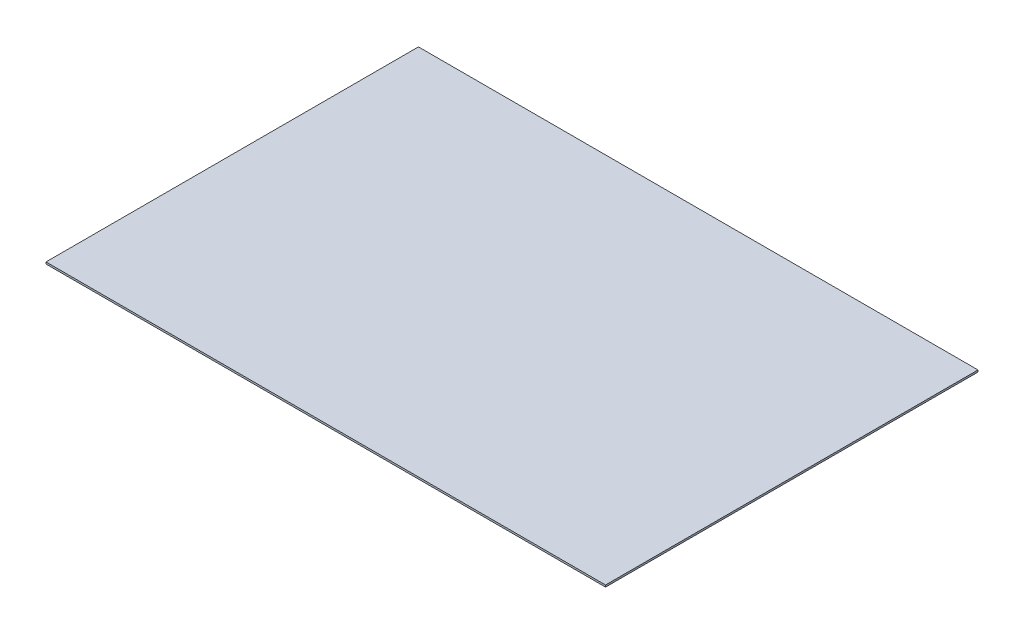
ISO-10303-21;
HEADER;
FILE_DESCRIPTION(('STEP AP214'),'2;1');
FILE_NAME('part.step','',(''),(''),'','','');
FILE_SCHEMA(('AUTOMOTIVE_DESIGN { 1 0 10303 214 1 1 1 1 }'));
ENDSEC;
DATA;
#1=APPLICATION_CONTEXT('core data for automotive mechanical design processes');
#2=APPLICATION_PROTOCOL_DEFINITION('international standard','automotive_design',2000,#1);
#3=PRODUCT_CONTEXT('',#1,'mechanical');
#4=PRODUCT('Part','Part','',(#3));
#5=PRODUCT_RELATED_PRODUCT_CATEGORY('part','',(#4));
#6=PRODUCT_DEFINITION_FORMATION('','',#4);
#7=PRODUCT_DEFINITION_CONTEXT('part definition',#1,'design');
#8=PRODUCT_DEFINITION('design','',#6,#7);
#9=PRODUCT_DEFINITION_SHAPE('','',#8);
#10=(LENGTH_UNIT() NAMED_UNIT(*) SI_UNIT(.MILLI.,.METRE.));
#11=(NAMED_UNIT(*) PLANE_ANGLE_UNIT() SI_UNIT($,.RADIAN.));
#12=(NAMED_UNIT(*) SI_UNIT($,.STERADIAN.) SOLID_ANGLE_UNIT());
#13=UNCERTAINTY_MEASURE_WITH_UNIT(LENGTH_MEASURE(1.E-05),#10,'distance_accuracy_value','');
#14=(GEOMETRIC_REPRESENTATION_CONTEXT(3) GLOBAL_UNCERTAINTY_ASSIGNED_CONTEXT((#13)) GLOBAL_UNIT_ASSIGNED_CONTEXT((#10,
#11,#12)) REPRESENTATION_CONTEXT('',''));
#15=CARTESIAN_POINT('',(0.,0.,0.));
#16=DIRECTION('',(0.,0.,1.));
#17=DIRECTION('',(1.,0.,0.));
#18=AXIS2_PLACEMENT_3D('',#15,#16,#17);
#19=CARTESIAN_POINT('',(0.,2.,0.));
#20=DIRECTION('',(1.,0.,0.));
#21=DIRECTION('',(0.,0.,-1.));
#22=AXIS2_PLACEMENT_3D('',#19,#20,#21);
#23=PLANE('',#22);
#24=DIRECTION('',(0.,0.,1.));
#25=VECTOR('',#24,1.);
#26=CARTESIAN_POINT('',(0.,0.,0.));
#27=LINE('',#26,#25);
#28=CARTESIAN_POINT('',(0.,0.,-399.38));
#29=VERTEX_POINT('',#28);
#30=CARTESIAN_POINT('',(0.,0.,0.));
#31=VERTEX_POINT('',#30);
#32=EDGE_CURVE('E105',#29,#31,#27,.T.);
#33=ORIENTED_EDGE('',*,*,#32,.T.);
#34=DIRECTION('',(0.,-1.,0.));
#35=VECTOR('',#34,1.);
#36=CARTESIAN_POINT('',(0.,2.,0.));
#37=LINE('',#36,#35);
#38=CARTESIAN_POINT('',(0.,2.,0.));
#39=VERTEX_POINT('',#38);
#40=EDGE_CURVE('E11',#39,#31,#37,.T.);
#41=ORIENTED_EDGE('',*,*,#40,.F.);
#42=DIRECTION('',(0.,0.,1.));
#43=VECTOR('',#42,1.);
#44=CARTESIAN_POINT('',(0.,2.,0.));
#45=LINE('',#44,#43);
#46=CARTESIAN_POINT('',(0.,2.,-399.38));
#47=VERTEX_POINT('',#46);
#48=EDGE_CURVE('E92',#47,#39,#45,.T.);
#49=ORIENTED_EDGE('',*,*,#48,.F.);
#50=DIRECTION('',(0.,-1.,0.));
#51=VECTOR('',#50,1.);
#52=CARTESIAN_POINT('',(0.,2.,-399.38));
#53=LINE('',#52,#51);
#54=EDGE_CURVE('E101',#47,#29,#53,.T.);
#55=ORIENTED_EDGE('',*,*,#54,.T.);
#56=EDGE_LOOP('',(#33,#41,#49,#55));
#57=FACE_BOUND('',#56,.T.);
#58=ADVANCED_FACE('F41',(#57),#23,.F.);
#59=CARTESIAN_POINT('',(0.,2.,0.));
#60=DIRECTION('',(0.,0.,-1.));
#61=DIRECTION('',(-1.,0.,0.));
#62=AXIS2_PLACEMENT_3D('',#59,#60,#61);
#63=PLANE('',#62);
#64=DIRECTION('',(1.,0.,0.));
#65=VECTOR('',#64,1.);
#66=CARTESIAN_POINT('',(0.,0.,0.));
#67=LINE('',#66,#65);
#68=CARTESIAN_POINT('',(600.,0.,0.));
#69=VERTEX_POINT('',#68);
#70=EDGE_CURVE('E96',#31,#69,#67,.T.);
#71=ORIENTED_EDGE('',*,*,#70,.T.);
#72=DIRECTION('',(0.,-1.,0.));
#73=VECTOR('',#72,1.);
#74=CARTESIAN_POINT('',(600.,2.,0.));
#75=LINE('',#74,#73);
#76=CARTESIAN_POINT('',(600.,2.,0.));
#77=VERTEX_POINT('',#76);
#78=EDGE_CURVE('E49',#77,#69,#75,.T.);
#79=ORIENTED_EDGE('',*,*,#78,.F.);
#80=DIRECTION('',(1.,0.,0.));
#81=VECTOR('',#80,1.);
#82=CARTESIAN_POINT('',(0.,2.,0.));
#83=LINE('',#82,#81);
#84=EDGE_CURVE('E87',#39,#77,#83,.T.);
#85=ORIENTED_EDGE('',*,*,#84,.F.);
#86=ORIENTED_EDGE('',*,*,#40,.T.);
#87=EDGE_LOOP('',(#71,#79,#85,#86));
#88=FACE_BOUND('',#87,.T.);
#89=ADVANCED_FACE('F95',(#88),#63,.F.);
#90=CARTESIAN_POINT('',(600.,2.,0.));
#91=DIRECTION('',(-1.,0.,0.));
#92=DIRECTION('',(0.,0.,1.));
#93=AXIS2_PLACEMENT_3D('',#90,#91,#92);
#94=PLANE('',#93);
#95=DIRECTION('',(0.,0.,-1.));
#96=VECTOR('',#95,1.);
#97=CARTESIAN_POINT('',(600.,0.,0.));
#98=LINE('',#97,#96);
#99=CARTESIAN_POINT('',(600.,0.,-399.38));
#100=VERTEX_POINT('',#99);
#101=EDGE_CURVE('E74',#69,#100,#98,.T.);
#102=ORIENTED_EDGE('',*,*,#101,.T.);
#103=DIRECTION('',(0.,-1.,0.));
#104=VECTOR('',#103,1.);
#105=CARTESIAN_POINT('',(600.,2.,-399.38));
#106=LINE('',#105,#104);
#107=CARTESIAN_POINT('',(600.,2.,-399.38));
#108=VERTEX_POINT('',#107);
#109=EDGE_CURVE('E97',#108,#100,#106,.T.);
#110=ORIENTED_EDGE('',*,*,#109,.F.);
#111=DIRECTION('',(0.,0.,-1.));
#112=VECTOR('',#111,1.);
#113=CARTESIAN_POINT('',(600.,2.,0.));
#114=LINE('',#113,#112);
#115=EDGE_CURVE('E90',#77,#108,#114,.T.);
#116=ORIENTED_EDGE('',*,*,#115,.F.);
#117=ORIENTED_EDGE('',*,*,#78,.T.);
#118=EDGE_LOOP('',(#102,#110,#116,#117));
#119=FACE_BOUND('',#118,.T.);
#120=ADVANCED_FACE('F98',(#119),#94,.F.);
#121=CARTESIAN_POINT('',(0.,2.,-399.38));
#122=DIRECTION('',(0.,0.,1.));
#123=DIRECTION('',(1.,0.,0.));
#124=AXIS2_PLACEMENT_3D('',#121,#122,#123);
#125=PLANE('',#124);
#126=DIRECTION('',(-1.,0.,0.));
#127=VECTOR('',#126,1.);
#128=CARTESIAN_POINT('',(0.,0.,-399.38));
#129=LINE('',#128,#127);
#130=EDGE_CURVE('E80',#100,#29,#129,.T.);
#131=ORIENTED_EDGE('',*,*,#130,.T.);
#132=ORIENTED_EDGE('',*,*,#54,.F.);
#133=DIRECTION('',(-1.,0.,0.));
#134=VECTOR('',#133,1.);
#135=CARTESIAN_POINT('',(0.,2.,-399.38));
#136=LINE('',#135,#134);
#137=EDGE_CURVE('E57',#108,#47,#136,.T.);
#138=ORIENTED_EDGE('',*,*,#137,.F.);
#139=ORIENTED_EDGE('',*,*,#109,.T.);
#140=EDGE_LOOP('',(#131,#132,#138,#139));
#141=FACE_BOUND('',#140,.T.);
#142=ADVANCED_FACE('F114',(#141),#125,.F.);
#143=CARTESIAN_POINT('',(0.,2.,0.));
#144=DIRECTION('',(0.,-1.,0.));
#145=DIRECTION('',(0.,0.,-1.));
#146=AXIS2_PLACEMENT_3D('',#143,#144,#145);
#147=PLANE('',#146);
#148=ORIENTED_EDGE('',*,*,#48,.T.);
#149=ORIENTED_EDGE('',*,*,#84,.T.);
#150=ORIENTED_EDGE('',*,*,#115,.T.);
#151=ORIENTED_EDGE('',*,*,#137,.T.);
#152=EDGE_LOOP('',(#148,#149,#150,#151));
#153=FACE_BOUND('',#152,.T.);
#154=ADVANCED_FACE('F88',(#153),#147,.F.);
#155=CARTESIAN_POINT('',(0.,0.,0.));
#156=DIRECTION('',(0.,-1.,0.));
#157=DIRECTION('',(0.,0.,-1.));
#158=AXIS2_PLACEMENT_3D('',#155,#156,#157);
#159=PLANE('',#158);
#160=ORIENTED_EDGE('',*,*,#32,.F.);
#161=ORIENTED_EDGE('',*,*,#130,.F.);
#162=ORIENTED_EDGE('',*,*,#101,.F.);
#163=ORIENTED_EDGE('',*,*,#70,.F.);
#164=EDGE_LOOP('',(#160,#161,#162,#163));
#165=FACE_BOUND('',#164,.T.);
#166=ADVANCED_FACE('F117',(#165),#159,.T.);
#167=CLOSED_SHELL('',(#58,#89,#120,#142,#154,#166));
#168=MANIFOLD_SOLID_BREP('B2',#167);
#169=ADVANCED_BREP_SHAPE_REPRESENTATION('',(#18,#168),#14);
#170=SHAPE_DEFINITION_REPRESENTATION(#9,#169);
ENDSEC;
END-ISO-10303-21;
